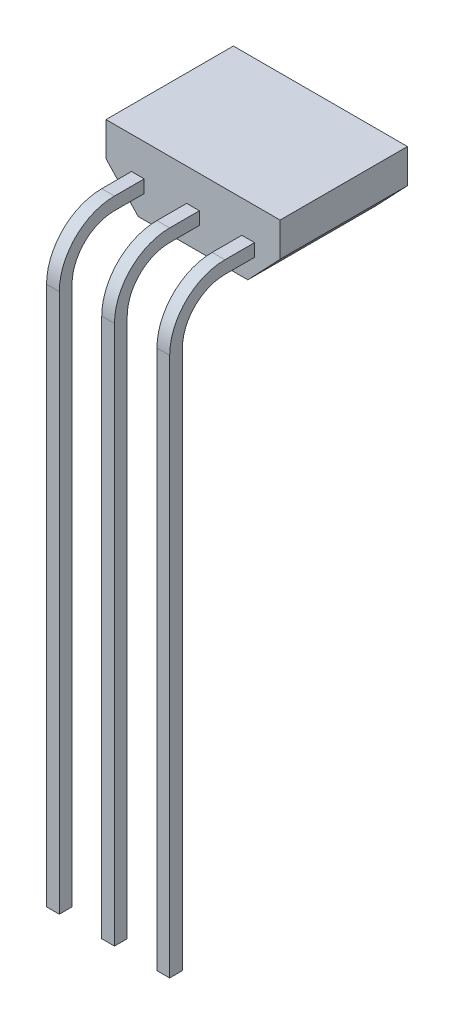
ISO-10303-21;
HEADER;
FILE_DESCRIPTION(('STEP AP214'),'2;1');
FILE_NAME('part.step','',(''),(''),'','','');
FILE_SCHEMA(('AUTOMOTIVE_DESIGN { 1 0 10303 214 1 1 1 1 }'));
ENDSEC;
DATA;
#1=APPLICATION_CONTEXT('core data for automotive mechanical design processes');
#2=APPLICATION_PROTOCOL_DEFINITION('international standard','automotive_design',2000,#1);
#3=PRODUCT_CONTEXT('',#1,'mechanical');
#4=PRODUCT('Part','Part','',(#3));
#5=PRODUCT_RELATED_PRODUCT_CATEGORY('part','',(#4));
#6=PRODUCT_DEFINITION_FORMATION('','',#4);
#7=PRODUCT_DEFINITION_CONTEXT('part definition',#1,'design');
#8=PRODUCT_DEFINITION('design','',#6,#7);
#9=PRODUCT_DEFINITION_SHAPE('','',#8);
#10=(LENGTH_UNIT() NAMED_UNIT(*) SI_UNIT(.MILLI.,.METRE.));
#11=(NAMED_UNIT(*) PLANE_ANGLE_UNIT() SI_UNIT($,.RADIAN.));
#12=(NAMED_UNIT(*) SI_UNIT($,.STERADIAN.) SOLID_ANGLE_UNIT());
#13=UNCERTAINTY_MEASURE_WITH_UNIT(LENGTH_MEASURE(1.E-05),#10,'distance_accuracy_value','');
#14=(GEOMETRIC_REPRESENTATION_CONTEXT(3) GLOBAL_UNCERTAINTY_ASSIGNED_CONTEXT((#13)) GLOBAL_UNIT_ASSIGNED_CONTEXT((#10,
#11,#12)) REPRESENTATION_CONTEXT('',''));
#15=CARTESIAN_POINT('',(0.,0.,0.));
#16=DIRECTION('',(0.,0.,1.));
#17=DIRECTION('',(1.,0.,0.));
#18=AXIS2_PLACEMENT_3D('',#15,#16,#17);
#19=CARTESIAN_POINT('',(2.05,1.6,1.5));
#20=DIRECTION('',(0.,0.,-1.));
#21=DIRECTION('',(-1.,0.,0.));
#22=AXIS2_PLACEMENT_3D('',#19,#20,#21);
#23=PLANE('',#22);
#24=DIRECTION('',(0.,1.,0.));
#25=VECTOR('',#24,1.);
#26=CARTESIAN_POINT('',(-1.15,0.839999999999998,1.5));
#27=LINE('',#26,#25);
#28=CARTESIAN_POINT('',(-1.15,0.539999999999998,1.5));
#29=VERTEX_POINT('',#28);
#30=CARTESIAN_POINT('',(-1.15,0.839999999999998,1.5));
#31=VERTEX_POINT('',#30);
#32=EDGE_CURVE('E266',#29,#31,#27,.T.);
#33=ORIENTED_EDGE('',*,*,#32,.F.);
#34=DIRECTION('',(-1.,0.,0.));
#35=VECTOR('',#34,1.);
#36=CARTESIAN_POINT('',(-1.15,0.539999999999998,1.5));
#37=LINE('',#36,#35);
#38=CARTESIAN_POINT('',(-1.45,0.539999999999998,1.5));
#39=VERTEX_POINT('',#38);
#40=EDGE_CURVE('E283',#29,#39,#37,.T.);
#41=ORIENTED_EDGE('',*,*,#40,.T.);
#42=DIRECTION('',(0.,1.,0.));
#43=VECTOR('',#42,1.);
#44=CARTESIAN_POINT('',(-1.45,0.839999999999998,1.5));
#45=LINE('',#44,#43);
#46=CARTESIAN_POINT('',(-1.45,0.839999999999998,1.5));
#47=VERTEX_POINT('',#46);
#48=EDGE_CURVE('E257',#39,#47,#45,.T.);
#49=ORIENTED_EDGE('',*,*,#48,.T.);
#50=DIRECTION('',(-1.,0.,0.));
#51=VECTOR('',#50,1.);
#52=CARTESIAN_POINT('',(-1.15,0.839999999999998,1.5));
#53=LINE('',#52,#51);
#54=EDGE_CURVE('E59',#31,#47,#53,.T.);
#55=ORIENTED_EDGE('',*,*,#54,.F.);
#56=EDGE_LOOP('',(#33,#41,#49,#55));
#57=FACE_BOUND('',#56,.T.);
#58=DIRECTION('',(0.,-1.,0.));
#59=VECTOR('',#58,1.);
#60=CARTESIAN_POINT('',(-2.05,1.6,1.5));
#61=LINE('',#60,#59);
#62=CARTESIAN_POINT('',(-2.05,1.6,1.5));
#63=VERTEX_POINT('',#62);
#64=CARTESIAN_POINT('',(-2.05,0.800000000000003,1.5));
#65=VERTEX_POINT('',#64);
#66=EDGE_CURVE('E399',#63,#65,#61,.T.);
#67=ORIENTED_EDGE('',*,*,#66,.T.);
#68=DIRECTION('',(-0.688749461914693,0.724999433594414,0.));
#69=VECTOR('',#68,1.);
#70=CARTESIAN_POINT('',(-2.05,0.800000000000003,1.5));
#71=LINE('',#70,#69);
#72=CARTESIAN_POINT('',(-1.29,0.,1.5));
#73=VERTEX_POINT('',#72);
#74=EDGE_CURVE('E407',#65,#73,#71,.F.);
#75=ORIENTED_EDGE('',*,*,#74,.T.);
#76=DIRECTION('',(1.,0.,0.));
#77=VECTOR('',#76,1.);
#78=CARTESIAN_POINT('',(2.05,0.,1.5));
#79=LINE('',#78,#77);
#80=CARTESIAN_POINT('',(1.29,0.,1.5));
#81=VERTEX_POINT('',#80);
#82=EDGE_CURVE('E375',#73,#81,#79,.T.);
#83=ORIENTED_EDGE('',*,*,#82,.T.);
#84=DIRECTION('',(-0.688749461914693,-0.724999433594414,0.));
#85=VECTOR('',#84,1.);
#86=CARTESIAN_POINT('',(2.05,0.800000000000003,1.5));
#87=LINE('',#86,#85);
#88=CARTESIAN_POINT('',(2.05,0.800000000000003,1.5));
#89=VERTEX_POINT('',#88);
#90=EDGE_CURVE('E405',#81,#89,#87,.F.);
#91=ORIENTED_EDGE('',*,*,#90,.T.);
#92=DIRECTION('',(0.,-1.,0.));
#93=VECTOR('',#92,1.);
#94=CARTESIAN_POINT('',(2.05,1.6,1.5));
#95=LINE('',#94,#93);
#96=CARTESIAN_POINT('',(2.05,1.6,1.5));
#97=VERTEX_POINT('',#96);
#98=EDGE_CURVE('E396',#97,#89,#95,.T.);
#99=ORIENTED_EDGE('',*,*,#98,.F.);
#100=DIRECTION('',(1.,0.,0.));
#101=VECTOR('',#100,1.);
#102=CARTESIAN_POINT('',(2.05,1.6,1.5));
#103=LINE('',#102,#101);
#104=EDGE_CURVE('E379',#63,#97,#103,.T.);
#105=ORIENTED_EDGE('',*,*,#104,.F.);
#106=EDGE_LOOP('',(#67,#75,#83,#91,#99,#105));
#107=FACE_BOUND('',#106,.T.);
#108=DIRECTION('',(0.,1.,0.));
#109=VECTOR('',#108,1.);
#110=CARTESIAN_POINT('',(0.15,0.839999999999998,1.5));
#111=LINE('',#110,#109);
#112=CARTESIAN_POINT('',(0.15,0.539999999999998,1.5));
#113=VERTEX_POINT('',#112);
#114=CARTESIAN_POINT('',(0.15,0.839999999999998,1.5));
#115=VERTEX_POINT('',#114);
#116=EDGE_CURVE('E319',#113,#115,#111,.T.);
#117=ORIENTED_EDGE('',*,*,#116,.F.);
#118=DIRECTION('',(-1.,0.,0.));
#119=VECTOR('',#118,1.);
#120=CARTESIAN_POINT('',(0.15,0.539999999999998,1.5));
#121=LINE('',#120,#119);
#122=CARTESIAN_POINT('',(-0.15,0.539999999999998,1.5));
#123=VERTEX_POINT('',#122);
#124=EDGE_CURVE('E337',#113,#123,#121,.T.);
#125=ORIENTED_EDGE('',*,*,#124,.T.);
#126=DIRECTION('',(0.,1.,0.));
#127=VECTOR('',#126,1.);
#128=CARTESIAN_POINT('',(-0.15,0.839999999999998,1.5));
#129=LINE('',#128,#127);
#130=CARTESIAN_POINT('',(-0.15,0.839999999999998,1.5));
#131=VERTEX_POINT('',#130);
#132=EDGE_CURVE('E318',#123,#131,#129,.T.);
#133=ORIENTED_EDGE('',*,*,#132,.T.);
#134=DIRECTION('',(-1.,0.,0.));
#135=VECTOR('',#134,1.);
#136=CARTESIAN_POINT('',(0.15,0.839999999999998,1.5));
#137=LINE('',#136,#135);
#138=EDGE_CURVE('E373',#115,#131,#137,.T.);
#139=ORIENTED_EDGE('',*,*,#138,.F.);
#140=EDGE_LOOP('',(#117,#125,#133,#139));
#141=FACE_BOUND('',#140,.T.);
#142=DIRECTION('',(0.,1.,0.));
#143=VECTOR('',#142,1.);
#144=CARTESIAN_POINT('',(1.15,0.839999999999998,1.5));
#145=LINE('',#144,#143);
#146=CARTESIAN_POINT('',(1.15,0.539999999999998,1.5));
#147=VERTEX_POINT('',#146);
#148=CARTESIAN_POINT('',(1.15,0.839999999999998,1.5));
#149=VERTEX_POINT('',#148);
#150=EDGE_CURVE('E235',#147,#149,#145,.T.);
#151=ORIENTED_EDGE('',*,*,#150,.T.);
#152=DIRECTION('',(1.,0.,0.));
#153=VECTOR('',#152,1.);
#154=CARTESIAN_POINT('',(1.15,0.839999999999998,1.5));
#155=LINE('',#154,#153);
#156=CARTESIAN_POINT('',(1.45,0.839999999999998,1.5));
#157=VERTEX_POINT('',#156);
#158=EDGE_CURVE('E779',#149,#157,#155,.T.);
#159=ORIENTED_EDGE('',*,*,#158,.T.);
#160=DIRECTION('',(0.,1.,0.));
#161=VECTOR('',#160,1.);
#162=CARTESIAN_POINT('',(1.45,0.839999999999998,1.5));
#163=LINE('',#162,#161);
#164=CARTESIAN_POINT('',(1.45,0.539999999999998,1.5));
#165=VERTEX_POINT('',#164);
#166=EDGE_CURVE('E256',#165,#157,#163,.T.);
#167=ORIENTED_EDGE('',*,*,#166,.F.);
#168=DIRECTION('',(1.,0.,0.));
#169=VECTOR('',#168,1.);
#170=CARTESIAN_POINT('',(1.15,0.539999999999998,1.5));
#171=LINE('',#170,#169);
#172=EDGE_CURVE('E251',#147,#165,#171,.T.);
#173=ORIENTED_EDGE('',*,*,#172,.F.);
#174=EDGE_LOOP('',(#151,#159,#167,#173));
#175=FACE_BOUND('',#174,.T.);
#176=ADVANCED_FACE('F35',(#57,#107,#141,#175),#23,.F.);
#177=CARTESIAN_POINT('',(-2.05,1.6,1.5));
#178=DIRECTION('',(1.,0.,0.));
#179=DIRECTION('',(0.,0.,-1.));
#180=AXIS2_PLACEMENT_3D('',#177,#178,#179);
#181=PLANE('',#180);
#182=DIRECTION('',(0.,-1.,0.));
#183=VECTOR('',#182,1.);
#184=CARTESIAN_POINT('',(-2.05,1.6,-1.5));
#185=LINE('',#184,#183);
#186=CARTESIAN_POINT('',(-2.05,1.6,-1.5));
#187=VERTEX_POINT('',#186);
#188=CARTESIAN_POINT('',(-2.05,0.800000000000003,-1.5));
#189=VERTEX_POINT('',#188);
#190=EDGE_CURVE('E386',#187,#189,#185,.T.);
#191=ORIENTED_EDGE('',*,*,#190,.T.);
#192=DIRECTION('',(0.,0.,1.));
#193=VECTOR('',#192,1.);
#194=CARTESIAN_POINT('',(-2.05,0.800000000000003,1.5));
#195=LINE('',#194,#193);
#196=EDGE_CURVE('E402',#189,#65,#195,.T.);
#197=ORIENTED_EDGE('',*,*,#196,.T.);
#198=ORIENTED_EDGE('',*,*,#66,.F.);
#199=DIRECTION('',(0.,0.,1.));
#200=VECTOR('',#199,1.);
#201=CARTESIAN_POINT('',(-2.05,1.6,1.5));
#202=LINE('',#201,#200);
#203=EDGE_CURVE('E376',#187,#63,#202,.T.);
#204=ORIENTED_EDGE('',*,*,#203,.F.);
#205=EDGE_LOOP('',(#191,#197,#198,#204));
#206=FACE_BOUND('',#205,.T.);
#207=ADVANCED_FACE('F425',(#206),#181,.F.);
#208=CARTESIAN_POINT('',(2.05,1.6,1.5));
#209=DIRECTION('',(-1.,0.,0.));
#210=DIRECTION('',(0.,0.,1.));
#211=AXIS2_PLACEMENT_3D('',#208,#209,#210);
#212=PLANE('',#211);
#213=ORIENTED_EDGE('',*,*,#98,.T.);
#214=DIRECTION('',(0.,0.,-1.));
#215=VECTOR('',#214,1.);
#216=CARTESIAN_POINT('',(2.05,0.800000000000003,1.5));
#217=LINE('',#216,#215);
#218=CARTESIAN_POINT('',(2.05,0.800000000000003,-1.5));
#219=VERTEX_POINT('',#218);
#220=EDGE_CURVE('E11',#89,#219,#217,.T.);
#221=ORIENTED_EDGE('',*,*,#220,.T.);
#222=DIRECTION('',(0.,-1.,0.));
#223=VECTOR('',#222,1.);
#224=CARTESIAN_POINT('',(2.05,1.6,-1.5));
#225=LINE('',#224,#223);
#226=CARTESIAN_POINT('',(2.05,1.6,-1.5));
#227=VERTEX_POINT('',#226);
#228=EDGE_CURVE('E393',#227,#219,#225,.T.);
#229=ORIENTED_EDGE('',*,*,#228,.F.);
#230=DIRECTION('',(0.,0.,-1.));
#231=VECTOR('',#230,1.);
#232=CARTESIAN_POINT('',(2.05,1.6,1.5));
#233=LINE('',#232,#231);
#234=EDGE_CURVE('E382',#97,#227,#233,.T.);
#235=ORIENTED_EDGE('',*,*,#234,.F.);
#236=EDGE_LOOP('',(#213,#221,#229,#235));
#237=FACE_BOUND('',#236,.T.);
#238=ADVANCED_FACE('F440',(#237),#212,.F.);
#239=CARTESIAN_POINT('',(2.05,1.6,-1.5));
#240=DIRECTION('',(0.,0.,1.));
#241=DIRECTION('',(1.,0.,0.));
#242=AXIS2_PLACEMENT_3D('',#239,#240,#241);
#243=PLANE('',#242);
#244=DIRECTION('',(-1.,0.,0.));
#245=VECTOR('',#244,1.);
#246=CARTESIAN_POINT('',(2.05,0.,-1.5));
#247=LINE('',#246,#245);
#248=CARTESIAN_POINT('',(1.29,0.,-1.5));
#249=VERTEX_POINT('',#248);
#250=CARTESIAN_POINT('',(-1.29,0.,-1.5));
#251=VERTEX_POINT('',#250);
#252=EDGE_CURVE('E380',#249,#251,#247,.T.);
#253=ORIENTED_EDGE('',*,*,#252,.T.);
#254=DIRECTION('',(0.688749461914693,-0.724999433594414,0.));
#255=VECTOR('',#254,1.);
#256=CARTESIAN_POINT('',(-2.05,0.800000000000003,-1.5));
#257=LINE('',#256,#255);
#258=EDGE_CURVE('E44',#251,#189,#257,.F.);
#259=ORIENTED_EDGE('',*,*,#258,.T.);
#260=ORIENTED_EDGE('',*,*,#190,.F.);
#261=DIRECTION('',(-1.,0.,0.));
#262=VECTOR('',#261,1.);
#263=CARTESIAN_POINT('',(2.05,1.6,-1.5));
#264=LINE('',#263,#262);
#265=EDGE_CURVE('E384',#227,#187,#264,.T.);
#266=ORIENTED_EDGE('',*,*,#265,.F.);
#267=ORIENTED_EDGE('',*,*,#228,.T.);
#268=DIRECTION('',(0.688749461914693,0.724999433594414,0.));
#269=VECTOR('',#268,1.);
#270=CARTESIAN_POINT('',(2.05,0.800000000000003,-1.5));
#271=LINE('',#270,#269);
#272=EDGE_CURVE('E413',#219,#249,#271,.F.);
#273=ORIENTED_EDGE('',*,*,#272,.T.);
#274=EDGE_LOOP('',(#253,#259,#260,#266,#267,#273));
#275=FACE_BOUND('',#274,.T.);
#276=ADVANCED_FACE('F417',(#275),#243,.F.);
#277=CARTESIAN_POINT('',(0.,1.6,0.));
#278=DIRECTION('',(0.,1.,0.));
#279=DIRECTION('',(0.,0.,1.));
#280=AXIS2_PLACEMENT_3D('',#277,#278,#279);
#281=PLANE('',#280);
#282=ORIENTED_EDGE('',*,*,#203,.T.);
#283=ORIENTED_EDGE('',*,*,#104,.T.);
#284=ORIENTED_EDGE('',*,*,#234,.T.);
#285=ORIENTED_EDGE('',*,*,#265,.T.);
#286=EDGE_LOOP('',(#282,#283,#284,#285));
#287=FACE_BOUND('',#286,.T.);
#288=ADVANCED_FACE('F443',(#287),#281,.T.);
#289=CARTESIAN_POINT('',(0.,0.,0.));
#290=DIRECTION('',(0.,1.,0.));
#291=DIRECTION('',(0.,0.,1.));
#292=AXIS2_PLACEMENT_3D('',#289,#290,#291);
#293=PLANE('',#292);
#294=ORIENTED_EDGE('',*,*,#82,.F.);
#295=DIRECTION('',(0.,0.,-1.));
#296=VECTOR('',#295,1.);
#297=CARTESIAN_POINT('',(-1.29,0.,0.));
#298=LINE('',#297,#296);
#299=EDGE_CURVE('E411',#73,#251,#298,.T.);
#300=ORIENTED_EDGE('',*,*,#299,.T.);
#301=ORIENTED_EDGE('',*,*,#252,.F.);
#302=DIRECTION('',(0.,0.,1.));
#303=VECTOR('',#302,1.);
#304=CARTESIAN_POINT('',(1.29,0.,0.));
#305=LINE('',#304,#303);
#306=EDGE_CURVE('E409',#249,#81,#305,.T.);
#307=ORIENTED_EDGE('',*,*,#306,.T.);
#308=EDGE_LOOP('',(#294,#300,#301,#307));
#309=FACE_BOUND('',#308,.T.);
#310=ADVANCED_FACE('F433',(#309),#293,.F.);
#311=CARTESIAN_POINT('',(-2.05,0.800000000000003,1.5));
#312=DIRECTION('',(0.724999433594414,0.688749461914693,0.));
#313=DIRECTION('',(0.,0.,1.));
#314=AXIS2_PLACEMENT_3D('',#311,#312,#313);
#315=PLANE('',#314);
#316=ORIENTED_EDGE('',*,*,#258,.F.);
#317=ORIENTED_EDGE('',*,*,#299,.F.);
#318=ORIENTED_EDGE('',*,*,#74,.F.);
#319=ORIENTED_EDGE('',*,*,#196,.F.);
#320=EDGE_LOOP('',(#316,#317,#318,#319));
#321=FACE_BOUND('',#320,.T.);
#322=ADVANCED_FACE('F427',(#321),#315,.F.);
#323=CARTESIAN_POINT('',(2.05,0.800000000000003,1.5));
#324=DIRECTION('',(-0.724999433594414,0.688749461914693,0.));
#325=DIRECTION('',(0.,0.,-1.));
#326=AXIS2_PLACEMENT_3D('',#323,#324,#325);
#327=PLANE('',#326);
#328=ORIENTED_EDGE('',*,*,#90,.F.);
#329=ORIENTED_EDGE('',*,*,#306,.F.);
#330=ORIENTED_EDGE('',*,*,#272,.F.);
#331=ORIENTED_EDGE('',*,*,#220,.F.);
#332=EDGE_LOOP('',(#328,#329,#330,#331));
#333=FACE_BOUND('',#332,.T.);
#334=ADVANCED_FACE('F38',(#333),#327,.F.);
#335=CARTESIAN_POINT('',(0.15,0.839999999999998,2.2));
#336=DIRECTION('',(0.,-1.,0.));
#337=DIRECTION('',(0.,0.,-1.));
#338=AXIS2_PLACEMENT_3D('',#335,#336,#337);
#339=PLANE('',#338);
#340=DIRECTION('',(0.,0.,1.));
#341=VECTOR('',#340,1.);
#342=CARTESIAN_POINT('',(-0.15,0.839999999999998,2.2));
#343=LINE('',#342,#341);
#344=CARTESIAN_POINT('',(-0.15,0.839999999999998,2.2));
#345=VERTEX_POINT('',#344);
#346=EDGE_CURVE('E340',#131,#345,#343,.T.);
#347=ORIENTED_EDGE('',*,*,#346,.T.);
#348=DIRECTION('',(-1.,0.,0.));
#349=VECTOR('',#348,1.);
#350=CARTESIAN_POINT('',(0.15,0.839999999999998,2.2));
#351=LINE('',#350,#349);
#352=CARTESIAN_POINT('',(0.15,0.839999999999998,2.2));
#353=VERTEX_POINT('',#352);
#354=EDGE_CURVE('E370',#353,#345,#351,.T.);
#355=ORIENTED_EDGE('',*,*,#354,.F.);
#356=DIRECTION('',(0.,0.,1.));
#357=VECTOR('',#356,1.);
#358=CARTESIAN_POINT('',(0.15,0.839999999999998,2.2));
#359=LINE('',#358,#357);
#360=EDGE_CURVE('E322',#115,#353,#359,.T.);
#361=ORIENTED_EDGE('',*,*,#360,.F.);
#362=ORIENTED_EDGE('',*,*,#138,.T.);
#363=EDGE_LOOP('',(#347,#355,#361,#362));
#364=FACE_BOUND('',#363,.T.);
#365=ADVANCED_FACE('F469',(#364),#339,.F.);
#366=CARTESIAN_POINT('',(0.15,-0.460000000000002,2.2));
#367=DIRECTION('',(-1.,0.,0.));
#368=DIRECTION('',(0.,0.,1.));
#369=AXIS2_PLACEMENT_3D('',#366,#367,#368);
#370=CYLINDRICAL_SURFACE('',#369,1.3);
#371=CARTESIAN_POINT('',(-0.15,-0.460000000000002,2.2));
#372=DIRECTION('',(1.,0.,0.));
#373=DIRECTION('',(0.,0.,-1.));
#374=AXIS2_PLACEMENT_3D('',#371,#372,#373);
#375=CIRCLE('',#374,1.3);
#376=CARTESIAN_POINT('',(-0.15,-0.460000000000002,3.5));
#377=VERTEX_POINT('',#376);
#378=EDGE_CURVE('E342',#345,#377,#375,.T.);
#379=ORIENTED_EDGE('',*,*,#378,.T.);
#380=DIRECTION('',(-1.,0.,0.));
#381=VECTOR('',#380,1.);
#382=CARTESIAN_POINT('',(0.15,-0.460000000000002,3.5));
#383=LINE('',#382,#381);
#384=CARTESIAN_POINT('',(0.15,-0.460000000000002,3.5));
#385=VERTEX_POINT('',#384);
#386=EDGE_CURVE('E367',#385,#377,#383,.T.);
#387=ORIENTED_EDGE('',*,*,#386,.F.);
#388=CARTESIAN_POINT('',(0.15,-0.460000000000002,2.2));
#389=DIRECTION('',(1.,0.,0.));
#390=DIRECTION('',(0.,0.,-1.));
#391=AXIS2_PLACEMENT_3D('',#388,#389,#390);
#392=CIRCLE('',#391,1.3);
#393=EDGE_CURVE('E325',#353,#385,#392,.T.);
#394=ORIENTED_EDGE('',*,*,#393,.F.);
#395=ORIENTED_EDGE('',*,*,#354,.T.);
#396=EDGE_LOOP('',(#379,#387,#394,#395));
#397=FACE_BOUND('',#396,.T.);
#398=ADVANCED_FACE('F473',(#397),#370,.T.);
#399=CARTESIAN_POINT('',(0.15,-0.460000000000002,3.5));
#400=DIRECTION('',(0.,0.,-1.));
#401=DIRECTION('',(0.,1.,0.));
#402=AXIS2_PLACEMENT_3D('',#399,#400,#401);
#403=PLANE('',#402);
#404=DIRECTION('',(0.,-1.,0.));
#405=VECTOR('',#404,1.);
#406=CARTESIAN_POINT('',(-0.15,-0.460000000000002,3.5));
#407=LINE('',#406,#405);
#408=CARTESIAN_POINT('',(-0.15,-13.16,3.5));
#409=VERTEX_POINT('',#408);
#410=EDGE_CURVE('E344',#377,#409,#407,.T.);
#411=ORIENTED_EDGE('',*,*,#410,.T.);
#412=DIRECTION('',(-1.,0.,0.));
#413=VECTOR('',#412,1.);
#414=CARTESIAN_POINT('',(0.15,-13.16,3.5));
#415=LINE('',#414,#413);
#416=CARTESIAN_POINT('',(0.15,-13.16,3.5));
#417=VERTEX_POINT('',#416);
#418=EDGE_CURVE('E364',#417,#409,#415,.T.);
#419=ORIENTED_EDGE('',*,*,#418,.F.);
#420=DIRECTION('',(0.,-1.,0.));
#421=VECTOR('',#420,1.);
#422=CARTESIAN_POINT('',(0.15,-0.460000000000002,3.5));
#423=LINE('',#422,#421);
#424=EDGE_CURVE('E327',#385,#417,#423,.T.);
#425=ORIENTED_EDGE('',*,*,#424,.F.);
#426=ORIENTED_EDGE('',*,*,#386,.T.);
#427=EDGE_LOOP('',(#411,#419,#425,#426));
#428=FACE_BOUND('',#427,.T.);
#429=ADVANCED_FACE('F478',(#428),#403,.F.);
#430=CARTESIAN_POINT('',(0.15,-13.16,3.5));
#431=DIRECTION('',(0.,1.,0.));
#432=DIRECTION('',(0.,0.,1.));
#433=AXIS2_PLACEMENT_3D('',#430,#431,#432);
#434=PLANE('',#433);
#435=DIRECTION('',(0.,0.,-1.));
#436=VECTOR('',#435,1.);
#437=CARTESIAN_POINT('',(-0.15,-13.16,3.5));
#438=LINE('',#437,#436);
#439=CARTESIAN_POINT('',(-0.15,-13.16,3.2));
#440=VERTEX_POINT('',#439);
#441=EDGE_CURVE('E346',#409,#440,#438,.T.);
#442=ORIENTED_EDGE('',*,*,#441,.T.);
#443=DIRECTION('',(-1.,0.,0.));
#444=VECTOR('',#443,1.);
#445=CARTESIAN_POINT('',(0.15,-13.16,3.2));
#446=LINE('',#445,#444);
#447=CARTESIAN_POINT('',(0.15,-13.16,3.2));
#448=VERTEX_POINT('',#447);
#449=EDGE_CURVE('E361',#448,#440,#446,.T.);
#450=ORIENTED_EDGE('',*,*,#449,.F.);
#451=DIRECTION('',(0.,0.,-1.));
#452=VECTOR('',#451,1.);
#453=CARTESIAN_POINT('',(0.15,-13.16,3.5));
#454=LINE('',#453,#452);
#455=EDGE_CURVE('E329',#417,#448,#454,.T.);
#456=ORIENTED_EDGE('',*,*,#455,.F.);
#457=ORIENTED_EDGE('',*,*,#418,.T.);
#458=EDGE_LOOP('',(#442,#450,#456,#457));
#459=FACE_BOUND('',#458,.T.);
#460=ADVANCED_FACE('F484',(#459),#434,.F.);
#461=CARTESIAN_POINT('',(0.15,-0.460000000000003,3.2));
#462=DIRECTION('',(0.,0.,1.));
#463=DIRECTION('',(0.,-1.,0.));
#464=AXIS2_PLACEMENT_3D('',#461,#462,#463);
#465=PLANE('',#464);
#466=DIRECTION('',(0.,1.,0.));
#467=VECTOR('',#466,1.);
#468=CARTESIAN_POINT('',(-0.15,-0.460000000000003,3.2));
#469=LINE('',#468,#467);
#470=CARTESIAN_POINT('',(-0.15,-0.460000000000003,3.2));
#471=VERTEX_POINT('',#470);
#472=EDGE_CURVE('E348',#440,#471,#469,.T.);
#473=ORIENTED_EDGE('',*,*,#472,.T.);
#474=DIRECTION('',(-1.,0.,0.));
#475=VECTOR('',#474,1.);
#476=CARTESIAN_POINT('',(0.15,-0.460000000000003,3.2));
#477=LINE('',#476,#475);
#478=CARTESIAN_POINT('',(0.15,-0.460000000000003,3.2));
#479=VERTEX_POINT('',#478);
#480=EDGE_CURVE('E358',#479,#471,#477,.T.);
#481=ORIENTED_EDGE('',*,*,#480,.F.);
#482=DIRECTION('',(0.,1.,0.));
#483=VECTOR('',#482,1.);
#484=CARTESIAN_POINT('',(0.15,-0.460000000000003,3.2));
#485=LINE('',#484,#483);
#486=EDGE_CURVE('E331',#448,#479,#485,.T.);
#487=ORIENTED_EDGE('',*,*,#486,.F.);
#488=ORIENTED_EDGE('',*,*,#449,.T.);
#489=EDGE_LOOP('',(#473,#481,#487,#488));
#490=FACE_BOUND('',#489,.T.);
#491=ADVANCED_FACE('F488',(#490),#465,.F.);
#492=CARTESIAN_POINT('',(0.15,-0.460000000000002,2.2));
#493=DIRECTION('',(-1.,0.,0.));
#494=DIRECTION('',(0.,0.,1.));
#495=AXIS2_PLACEMENT_3D('',#492,#493,#494);
#496=CYLINDRICAL_SURFACE('',#495,1.);
#497=CARTESIAN_POINT('',(-0.15,-0.460000000000002,2.2));
#498=DIRECTION('',(-1.,0.,0.));
#499=DIRECTION('',(0.,0.,1.));
#500=AXIS2_PLACEMENT_3D('',#497,#498,#499);
#501=CIRCLE('',#500,1.);
#502=CARTESIAN_POINT('',(-0.15,0.539999999999997,2.19999999999999));
#503=VERTEX_POINT('',#502);
#504=EDGE_CURVE('E350',#471,#503,#501,.T.);
#505=ORIENTED_EDGE('',*,*,#504,.T.);
#506=DIRECTION('',(-1.,0.,0.));
#507=VECTOR('',#506,1.);
#508=CARTESIAN_POINT('',(0.15,0.539999999999997,2.19999999999999));
#509=LINE('',#508,#507);
#510=CARTESIAN_POINT('',(0.15,0.539999999999997,2.19999999999999));
#511=VERTEX_POINT('',#510);
#512=EDGE_CURVE('E355',#511,#503,#509,.T.);
#513=ORIENTED_EDGE('',*,*,#512,.F.);
#514=CARTESIAN_POINT('',(0.15,-0.460000000000002,2.2));
#515=DIRECTION('',(-1.,0.,0.));
#516=DIRECTION('',(0.,0.,1.));
#517=AXIS2_PLACEMENT_3D('',#514,#515,#516);
#518=CIRCLE('',#517,1.);
#519=EDGE_CURVE('E333',#479,#511,#518,.T.);
#520=ORIENTED_EDGE('',*,*,#519,.F.);
#521=ORIENTED_EDGE('',*,*,#480,.T.);
#522=EDGE_LOOP('',(#505,#513,#520,#521));
#523=FACE_BOUND('',#522,.T.);
#524=ADVANCED_FACE('F492',(#523),#496,.F.);
#525=CARTESIAN_POINT('',(0.15,0.539999999999998,1.5));
#526=DIRECTION('',(0.,1.,0.));
#527=DIRECTION('',(0.,0.,1.));
#528=AXIS2_PLACEMENT_3D('',#525,#526,#527);
#529=PLANE('',#528);
#530=DIRECTION('',(0.,0.,-1.));
#531=VECTOR('',#530,1.);
#532=CARTESIAN_POINT('',(-0.15,0.539999999999998,1.5));
#533=LINE('',#532,#531);
#534=EDGE_CURVE('E323',#503,#123,#533,.T.);
#535=ORIENTED_EDGE('',*,*,#534,.T.);
#536=ORIENTED_EDGE('',*,*,#124,.F.);
#537=DIRECTION('',(0.,0.,-1.));
#538=VECTOR('',#537,1.);
#539=CARTESIAN_POINT('',(0.15,0.539999999999998,1.5));
#540=LINE('',#539,#538);
#541=EDGE_CURVE('E335',#511,#113,#540,.T.);
#542=ORIENTED_EDGE('',*,*,#541,.F.);
#543=ORIENTED_EDGE('',*,*,#512,.T.);
#544=EDGE_LOOP('',(#535,#536,#542,#543));
#545=FACE_BOUND('',#544,.T.);
#546=ADVANCED_FACE('F496',(#545),#529,.F.);
#547=CARTESIAN_POINT('',(0.15,-0.460000000000002,2.2));
#548=DIRECTION('',(-1.,0.,0.));
#549=DIRECTION('',(0.,0.,1.));
#550=AXIS2_PLACEMENT_3D('',#547,#548,#549);
#551=PLANE('',#550);
#552=ORIENTED_EDGE('',*,*,#116,.T.);
#553=ORIENTED_EDGE('',*,*,#360,.T.);
#554=ORIENTED_EDGE('',*,*,#393,.T.);
#555=ORIENTED_EDGE('',*,*,#424,.T.);
#556=ORIENTED_EDGE('',*,*,#455,.T.);
#557=ORIENTED_EDGE('',*,*,#486,.T.);
#558=ORIENTED_EDGE('',*,*,#519,.T.);
#559=ORIENTED_EDGE('',*,*,#541,.T.);
#560=EDGE_LOOP('',(#552,#553,#554,#555,#556,#557,#558,#559));
#561=FACE_BOUND('',#560,.T.);
#562=ADVANCED_FACE('F500',(#561),#551,.F.);
#563=CARTESIAN_POINT('',(-0.15,-0.460000000000002,2.2));
#564=DIRECTION('',(-1.,0.,0.));
#565=DIRECTION('',(0.,0.,1.));
#566=AXIS2_PLACEMENT_3D('',#563,#564,#565);
#567=PLANE('',#566);
#568=ORIENTED_EDGE('',*,*,#132,.F.);
#569=ORIENTED_EDGE('',*,*,#534,.F.);
#570=ORIENTED_EDGE('',*,*,#504,.F.);
#571=ORIENTED_EDGE('',*,*,#472,.F.);
#572=ORIENTED_EDGE('',*,*,#441,.F.);
#573=ORIENTED_EDGE('',*,*,#410,.F.);
#574=ORIENTED_EDGE('',*,*,#378,.F.);
#575=ORIENTED_EDGE('',*,*,#346,.F.);
#576=EDGE_LOOP('',(#568,#569,#570,#571,#572,#573,#574,#575));
#577=FACE_BOUND('',#576,.T.);
#578=ADVANCED_FACE('F502',(#577),#567,.T.);
#579=CARTESIAN_POINT('',(-1.15,0.839999999999998,2.2));
#580=DIRECTION('',(0.,-1.,0.));
#581=DIRECTION('',(0.,0.,-1.));
#582=AXIS2_PLACEMENT_3D('',#579,#580,#581);
#583=PLANE('',#582);
#584=DIRECTION('',(0.,0.,1.));
#585=VECTOR('',#584,1.);
#586=CARTESIAN_POINT('',(-1.45,0.839999999999998,2.2));
#587=LINE('',#586,#585);
#588=CARTESIAN_POINT('',(-1.45,0.839999999999998,2.2));
#589=VERTEX_POINT('',#588);
#590=EDGE_CURVE('E260',#47,#589,#587,.T.);
#591=ORIENTED_EDGE('',*,*,#590,.T.);
#592=DIRECTION('',(-1.,0.,0.));
#593=VECTOR('',#592,1.);
#594=CARTESIAN_POINT('',(-1.15,0.839999999999998,2.2));
#595=LINE('',#594,#593);
#596=CARTESIAN_POINT('',(-1.15,0.839999999999998,2.2));
#597=VERTEX_POINT('',#596);
#598=EDGE_CURVE('E314',#597,#589,#595,.T.);
#599=ORIENTED_EDGE('',*,*,#598,.F.);
#600=DIRECTION('',(0.,0.,1.));
#601=VECTOR('',#600,1.);
#602=CARTESIAN_POINT('',(-1.15,0.839999999999998,2.2));
#603=LINE('',#602,#601);
#604=EDGE_CURVE('E269',#31,#597,#603,.T.);
#605=ORIENTED_EDGE('',*,*,#604,.F.);
#606=ORIENTED_EDGE('',*,*,#54,.T.);
#607=EDGE_LOOP('',(#591,#599,#605,#606));
#608=FACE_BOUND('',#607,.T.);
#609=ADVANCED_FACE('F505',(#608),#583,.F.);
#610=CARTESIAN_POINT('',(-1.15,-0.460000000000002,2.2));
#611=DIRECTION('',(-1.,0.,0.));
#612=DIRECTION('',(0.,0.,1.));
#613=AXIS2_PLACEMENT_3D('',#610,#611,#612);
#614=CYLINDRICAL_SURFACE('',#613,1.3);
#615=CARTESIAN_POINT('',(-1.45,-0.460000000000002,2.2));
#616=DIRECTION('',(1.,0.,0.));
#617=DIRECTION('',(0.,0.,-1.));
#618=AXIS2_PLACEMENT_3D('',#615,#616,#617);
#619=CIRCLE('',#618,1.3);
#620=CARTESIAN_POINT('',(-1.45,-0.460000000000002,3.5));
#621=VERTEX_POINT('',#620);
#622=EDGE_CURVE('E286',#589,#621,#619,.T.);
#623=ORIENTED_EDGE('',*,*,#622,.T.);
#624=DIRECTION('',(-1.,0.,0.));
#625=VECTOR('',#624,1.);
#626=CARTESIAN_POINT('',(-1.15,-0.460000000000002,3.5));
#627=LINE('',#626,#625);
#628=CARTESIAN_POINT('',(-1.15,-0.460000000000002,3.5));
#629=VERTEX_POINT('',#628);
#630=EDGE_CURVE('E311',#629,#621,#627,.T.);
#631=ORIENTED_EDGE('',*,*,#630,.F.);
#632=CARTESIAN_POINT('',(-1.15,-0.460000000000002,2.2));
#633=DIRECTION('',(1.,0.,0.));
#634=DIRECTION('',(0.,0.,-1.));
#635=AXIS2_PLACEMENT_3D('',#632,#633,#634);
#636=CIRCLE('',#635,1.3);
#637=EDGE_CURVE('E272',#597,#629,#636,.T.);
#638=ORIENTED_EDGE('',*,*,#637,.F.);
#639=ORIENTED_EDGE('',*,*,#598,.T.);
#640=EDGE_LOOP('',(#623,#631,#638,#639));
#641=FACE_BOUND('',#640,.T.);
#642=ADVANCED_FACE('F512',(#641),#614,.T.);
#643=CARTESIAN_POINT('',(-1.15,-0.460000000000002,3.5));
#644=DIRECTION('',(0.,0.,-1.));
#645=DIRECTION('',(0.,1.,0.));
#646=AXIS2_PLACEMENT_3D('',#643,#644,#645);
#647=PLANE('',#646);
#648=DIRECTION('',(0.,-1.,0.));
#649=VECTOR('',#648,1.);
#650=CARTESIAN_POINT('',(-1.45,-0.460000000000002,3.5));
#651=LINE('',#650,#649);
#652=CARTESIAN_POINT('',(-1.45,-13.16,3.5));
#653=VERTEX_POINT('',#652);
#654=EDGE_CURVE('E288',#621,#653,#651,.T.);
#655=ORIENTED_EDGE('',*,*,#654,.T.);
#656=DIRECTION('',(-1.,0.,0.));
#657=VECTOR('',#656,1.);
#658=CARTESIAN_POINT('',(-1.15,-13.16,3.5));
#659=LINE('',#658,#657);
#660=CARTESIAN_POINT('',(-1.15,-13.16,3.5));
#661=VERTEX_POINT('',#660);
#662=EDGE_CURVE('E308',#661,#653,#659,.T.);
#663=ORIENTED_EDGE('',*,*,#662,.F.);
#664=DIRECTION('',(0.,-1.,0.));
#665=VECTOR('',#664,1.);
#666=CARTESIAN_POINT('',(-1.15,-0.460000000000002,3.5));
#667=LINE('',#666,#665);
#668=EDGE_CURVE('E274',#629,#661,#667,.T.);
#669=ORIENTED_EDGE('',*,*,#668,.F.);
#670=ORIENTED_EDGE('',*,*,#630,.T.);
#671=EDGE_LOOP('',(#655,#663,#669,#670));
#672=FACE_BOUND('',#671,.T.);
#673=ADVANCED_FACE('F515',(#672),#647,.F.);
#674=CARTESIAN_POINT('',(-1.15,-13.16,3.5));
#675=DIRECTION('',(0.,1.,0.));
#676=DIRECTION('',(0.,0.,1.));
#677=AXIS2_PLACEMENT_3D('',#674,#675,#676);
#678=PLANE('',#677);
#679=DIRECTION('',(0.,0.,-1.));
#680=VECTOR('',#679,1.);
#681=CARTESIAN_POINT('',(-1.45,-13.16,3.5));
#682=LINE('',#681,#680);
#683=CARTESIAN_POINT('',(-1.45,-13.16,3.2));
#684=VERTEX_POINT('',#683);
#685=EDGE_CURVE('E290',#653,#684,#682,.T.);
#686=ORIENTED_EDGE('',*,*,#685,.T.);
#687=DIRECTION('',(-1.,0.,0.));
#688=VECTOR('',#687,1.);
#689=CARTESIAN_POINT('',(-1.15,-13.16,3.2));
#690=LINE('',#689,#688);
#691=CARTESIAN_POINT('',(-1.15,-13.16,3.2));
#692=VERTEX_POINT('',#691);
#693=EDGE_CURVE('E305',#692,#684,#690,.T.);
#694=ORIENTED_EDGE('',*,*,#693,.F.);
#695=DIRECTION('',(0.,0.,-1.));
#696=VECTOR('',#695,1.);
#697=CARTESIAN_POINT('',(-1.15,-13.16,3.5));
#698=LINE('',#697,#696);
#699=EDGE_CURVE('E276',#661,#692,#698,.T.);
#700=ORIENTED_EDGE('',*,*,#699,.F.);
#701=ORIENTED_EDGE('',*,*,#662,.T.);
#702=EDGE_LOOP('',(#686,#694,#700,#701));
#703=FACE_BOUND('',#702,.T.);
#704=ADVANCED_FACE('F519',(#703),#678,.F.);
#705=CARTESIAN_POINT('',(-1.15,-0.460000000000003,3.2));
#706=DIRECTION('',(0.,0.,1.));
#707=DIRECTION('',(0.,-1.,0.));
#708=AXIS2_PLACEMENT_3D('',#705,#706,#707);
#709=PLANE('',#708);
#710=DIRECTION('',(0.,1.,0.));
#711=VECTOR('',#710,1.);
#712=CARTESIAN_POINT('',(-1.45,-0.460000000000003,3.2));
#713=LINE('',#712,#711);
#714=CARTESIAN_POINT('',(-1.45,-0.460000000000003,3.2));
#715=VERTEX_POINT('',#714);
#716=EDGE_CURVE('E292',#684,#715,#713,.T.);
#717=ORIENTED_EDGE('',*,*,#716,.T.);
#718=DIRECTION('',(-1.,0.,0.));
#719=VECTOR('',#718,1.);
#720=CARTESIAN_POINT('',(-1.15,-0.460000000000003,3.2));
#721=LINE('',#720,#719);
#722=CARTESIAN_POINT('',(-1.15,-0.460000000000003,3.2));
#723=VERTEX_POINT('',#722);
#724=EDGE_CURVE('E302',#723,#715,#721,.T.);
#725=ORIENTED_EDGE('',*,*,#724,.F.);
#726=DIRECTION('',(0.,1.,0.));
#727=VECTOR('',#726,1.);
#728=CARTESIAN_POINT('',(-1.15,-0.460000000000003,3.2));
#729=LINE('',#728,#727);
#730=EDGE_CURVE('E278',#692,#723,#729,.T.);
#731=ORIENTED_EDGE('',*,*,#730,.F.);
#732=ORIENTED_EDGE('',*,*,#693,.T.);
#733=EDGE_LOOP('',(#717,#725,#731,#732));
#734=FACE_BOUND('',#733,.T.);
#735=ADVANCED_FACE('F523',(#734),#709,.F.);
#736=CARTESIAN_POINT('',(-1.15,-0.460000000000002,2.2));
#737=DIRECTION('',(-1.,0.,0.));
#738=DIRECTION('',(0.,0.,1.));
#739=AXIS2_PLACEMENT_3D('',#736,#737,#738);
#740=CYLINDRICAL_SURFACE('',#739,1.);
#741=CARTESIAN_POINT('',(-1.45,-0.460000000000002,2.2));
#742=DIRECTION('',(-1.,0.,0.));
#743=DIRECTION('',(0.,0.,1.));
#744=AXIS2_PLACEMENT_3D('',#741,#742,#743);
#745=CIRCLE('',#744,1.);
#746=CARTESIAN_POINT('',(-1.45,0.539999999999997,2.19999999999999));
#747=VERTEX_POINT('',#746);
#748=EDGE_CURVE('E294',#715,#747,#745,.T.);
#749=ORIENTED_EDGE('',*,*,#748,.T.);
#750=DIRECTION('',(-1.,0.,0.));
#751=VECTOR('',#750,1.);
#752=CARTESIAN_POINT('',(-1.15,0.539999999999997,2.19999999999999));
#753=LINE('',#752,#751);
#754=CARTESIAN_POINT('',(-1.15,0.539999999999997,2.19999999999999));
#755=VERTEX_POINT('',#754);
#756=EDGE_CURVE('E299',#755,#747,#753,.T.);
#757=ORIENTED_EDGE('',*,*,#756,.F.);
#758=CARTESIAN_POINT('',(-1.15,-0.460000000000002,2.2));
#759=DIRECTION('',(-1.,0.,0.));
#760=DIRECTION('',(0.,0.,1.));
#761=AXIS2_PLACEMENT_3D('',#758,#759,#760);
#762=CIRCLE('',#761,1.);
#763=EDGE_CURVE('E280',#723,#755,#762,.T.);
#764=ORIENTED_EDGE('',*,*,#763,.F.);
#765=ORIENTED_EDGE('',*,*,#724,.T.);
#766=EDGE_LOOP('',(#749,#757,#764,#765));
#767=FACE_BOUND('',#766,.T.);
#768=ADVANCED_FACE('F527',(#767),#740,.F.);
#769=CARTESIAN_POINT('',(-1.15,0.539999999999998,1.5));
#770=DIRECTION('',(0.,1.,0.));
#771=DIRECTION('',(0.,0.,1.));
#772=AXIS2_PLACEMENT_3D('',#769,#770,#771);
#773=PLANE('',#772);
#774=DIRECTION('',(0.,0.,-1.));
#775=VECTOR('',#774,1.);
#776=CARTESIAN_POINT('',(-1.45,0.539999999999998,1.5));
#777=LINE('',#776,#775);
#778=EDGE_CURVE('E270',#747,#39,#777,.T.);
#779=ORIENTED_EDGE('',*,*,#778,.T.);
#780=ORIENTED_EDGE('',*,*,#40,.F.);
#781=DIRECTION('',(0.,0.,-1.));
#782=VECTOR('',#781,1.);
#783=CARTESIAN_POINT('',(-1.15,0.539999999999998,1.5));
#784=LINE('',#783,#782);
#785=EDGE_CURVE('E282',#755,#29,#784,.T.);
#786=ORIENTED_EDGE('',*,*,#785,.F.);
#787=ORIENTED_EDGE('',*,*,#756,.T.);
#788=EDGE_LOOP('',(#779,#780,#786,#787));
#789=FACE_BOUND('',#788,.T.);
#790=ADVANCED_FACE('F531',(#789),#773,.F.);
#791=CARTESIAN_POINT('',(-1.15,-0.460000000000002,2.2));
#792=DIRECTION('',(-1.,0.,0.));
#793=DIRECTION('',(0.,0.,1.));
#794=AXIS2_PLACEMENT_3D('',#791,#792,#793);
#795=PLANE('',#794);
#796=ORIENTED_EDGE('',*,*,#32,.T.);
#797=ORIENTED_EDGE('',*,*,#604,.T.);
#798=ORIENTED_EDGE('',*,*,#637,.T.);
#799=ORIENTED_EDGE('',*,*,#668,.T.);
#800=ORIENTED_EDGE('',*,*,#699,.T.);
#801=ORIENTED_EDGE('',*,*,#730,.T.);
#802=ORIENTED_EDGE('',*,*,#763,.T.);
#803=ORIENTED_EDGE('',*,*,#785,.T.);
#804=EDGE_LOOP('',(#796,#797,#798,#799,#800,#801,#802,#803));
#805=FACE_BOUND('',#804,.T.);
#806=ADVANCED_FACE('F535',(#805),#795,.F.);
#807=CARTESIAN_POINT('',(-1.45,-0.460000000000002,2.2));
#808=DIRECTION('',(-1.,0.,0.));
#809=DIRECTION('',(0.,0.,1.));
#810=AXIS2_PLACEMENT_3D('',#807,#808,#809);
#811=PLANE('',#810);
#812=ORIENTED_EDGE('',*,*,#48,.F.);
#813=ORIENTED_EDGE('',*,*,#778,.F.);
#814=ORIENTED_EDGE('',*,*,#748,.F.);
#815=ORIENTED_EDGE('',*,*,#716,.F.);
#816=ORIENTED_EDGE('',*,*,#685,.F.);
#817=ORIENTED_EDGE('',*,*,#654,.F.);
#818=ORIENTED_EDGE('',*,*,#622,.F.);
#819=ORIENTED_EDGE('',*,*,#590,.F.);
#820=EDGE_LOOP('',(#812,#813,#814,#815,#816,#817,#818,#819));
#821=FACE_BOUND('',#820,.T.);
#822=ADVANCED_FACE('F537',(#821),#811,.T.);
#823=CARTESIAN_POINT('',(1.15,0.539999999999998,1.5));
#824=DIRECTION('',(0.,-1.,0.));
#825=DIRECTION('',(0.,0.,-1.));
#826=AXIS2_PLACEMENT_3D('',#823,#824,#825);
#827=PLANE('',#826);
#828=DIRECTION('',(0.,0.,-1.));
#829=VECTOR('',#828,1.);
#830=CARTESIAN_POINT('',(1.45,0.539999999999998,1.5));
#831=LINE('',#830,#829);
#832=CARTESIAN_POINT('',(1.45,0.539999999999997,2.19999999999999));
#833=VERTEX_POINT('',#832);
#834=EDGE_CURVE('E51',#833,#165,#831,.T.);
#835=ORIENTED_EDGE('',*,*,#834,.F.);
#836=DIRECTION('',(1.,0.,0.));
#837=VECTOR('',#836,1.);
#838=CARTESIAN_POINT('',(1.15,0.539999999999997,2.19999999999999));
#839=LINE('',#838,#837);
#840=CARTESIAN_POINT('',(1.15,0.539999999999997,2.19999999999999));
#841=VERTEX_POINT('',#840);
#842=EDGE_CURVE('E253',#841,#833,#839,.T.);
#843=ORIENTED_EDGE('',*,*,#842,.F.);
#844=DIRECTION('',(0.,0.,-1.));
#845=VECTOR('',#844,1.);
#846=CARTESIAN_POINT('',(1.15,0.539999999999998,1.5));
#847=LINE('',#846,#845);
#848=EDGE_CURVE('E239',#841,#147,#847,.T.);
#849=ORIENTED_EDGE('',*,*,#848,.T.);
#850=ORIENTED_EDGE('',*,*,#172,.T.);
#851=EDGE_LOOP('',(#835,#843,#849,#850));
#852=FACE_BOUND('',#851,.T.);
#853=ADVANCED_FACE('F250',(#852),#827,.T.);
#854=CARTESIAN_POINT('',(1.15,-0.460000000000002,2.2));
#855=DIRECTION('',(1.,0.,0.));
#856=DIRECTION('',(0.,0.,-1.));
#857=AXIS2_PLACEMENT_3D('',#854,#855,#856);
#858=CYLINDRICAL_SURFACE('',#857,1.);
#859=CARTESIAN_POINT('',(1.45,-0.460000000000002,2.2));
#860=DIRECTION('',(-1.,0.,0.));
#861=DIRECTION('',(0.,0.,1.));
#862=AXIS2_PLACEMENT_3D('',#859,#860,#861);
#863=CIRCLE('',#862,1.);
#864=CARTESIAN_POINT('',(1.45,-0.460000000000003,3.2));
#865=VERTEX_POINT('',#864);
#866=EDGE_CURVE('E803',#865,#833,#863,.T.);
#867=ORIENTED_EDGE('',*,*,#866,.F.);
#868=DIRECTION('',(1.,0.,0.));
#869=VECTOR('',#868,1.);
#870=CARTESIAN_POINT('',(1.15,-0.460000000000003,3.2));
#871=LINE('',#870,#869);
#872=CARTESIAN_POINT('',(1.15,-0.460000000000003,3.2));
#873=VERTEX_POINT('',#872);
#874=EDGE_CURVE('E262',#873,#865,#871,.T.);
#875=ORIENTED_EDGE('',*,*,#874,.F.);
#876=CARTESIAN_POINT('',(1.15,-0.460000000000002,2.2));
#877=DIRECTION('',(-1.,0.,0.));
#878=DIRECTION('',(0.,0.,1.));
#879=AXIS2_PLACEMENT_3D('',#876,#877,#878);
#880=CIRCLE('',#879,1.);
#881=EDGE_CURVE('E254',#873,#841,#880,.T.);
#882=ORIENTED_EDGE('',*,*,#881,.T.);
#883=ORIENTED_EDGE('',*,*,#842,.T.);
#884=EDGE_LOOP('',(#867,#875,#882,#883));
#885=FACE_BOUND('',#884,.T.);
#886=ADVANCED_FACE('F546',(#885),#858,.F.);
#887=CARTESIAN_POINT('',(1.15,-0.460000000000003,3.2));
#888=DIRECTION('',(0.,0.,-1.));
#889=DIRECTION('',(0.,1.,0.));
#890=AXIS2_PLACEMENT_3D('',#887,#888,#889);
#891=PLANE('',#890);
#892=DIRECTION('',(0.,1.,0.));
#893=VECTOR('',#892,1.);
#894=CARTESIAN_POINT('',(1.45,-0.460000000000003,3.2));
#895=LINE('',#894,#893);
#896=CARTESIAN_POINT('',(1.45,-13.16,3.2));
#897=VERTEX_POINT('',#896);
#898=EDGE_CURVE('E799',#897,#865,#895,.T.);
#899=ORIENTED_EDGE('',*,*,#898,.F.);
#900=DIRECTION('',(1.,0.,0.));
#901=VECTOR('',#900,1.);
#902=CARTESIAN_POINT('',(1.15,-13.16,3.2));
#903=LINE('',#902,#901);
#904=CARTESIAN_POINT('',(1.15,-13.16,3.2));
#905=VERTEX_POINT('',#904);
#906=EDGE_CURVE('E794',#905,#897,#903,.T.);
#907=ORIENTED_EDGE('',*,*,#906,.F.);
#908=DIRECTION('',(0.,1.,0.));
#909=VECTOR('',#908,1.);
#910=CARTESIAN_POINT('',(1.15,-0.460000000000003,3.2));
#911=LINE('',#910,#909);
#912=EDGE_CURVE('E802',#905,#873,#911,.T.);
#913=ORIENTED_EDGE('',*,*,#912,.T.);
#914=ORIENTED_EDGE('',*,*,#874,.T.);
#915=EDGE_LOOP('',(#899,#907,#913,#914));
#916=FACE_BOUND('',#915,.T.);
#917=ADVANCED_FACE('F549',(#916),#891,.T.);
#918=CARTESIAN_POINT('',(1.15,-13.16,3.5));
#919=DIRECTION('',(0.,-1.,0.));
#920=DIRECTION('',(0.,0.,-1.));
#921=AXIS2_PLACEMENT_3D('',#918,#919,#920);
#922=PLANE('',#921);
#923=DIRECTION('',(0.,0.,-1.));
#924=VECTOR('',#923,1.);
#925=CARTESIAN_POINT('',(1.45,-13.16,3.5));
#926=LINE('',#925,#924);
#927=CARTESIAN_POINT('',(1.45,-13.16,3.5));
#928=VERTEX_POINT('',#927);
#929=EDGE_CURVE('E807',#928,#897,#926,.T.);
#930=ORIENTED_EDGE('',*,*,#929,.F.);
#931=DIRECTION('',(1.,0.,0.));
#932=VECTOR('',#931,1.);
#933=CARTESIAN_POINT('',(1.15,-13.16,3.5));
#934=LINE('',#933,#932);
#935=CARTESIAN_POINT('',(1.15,-13.16,3.5));
#936=VERTEX_POINT('',#935);
#937=EDGE_CURVE('E792',#936,#928,#934,.T.);
#938=ORIENTED_EDGE('',*,*,#937,.F.);
#939=DIRECTION('',(0.,0.,-1.));
#940=VECTOR('',#939,1.);
#941=CARTESIAN_POINT('',(1.15,-13.16,3.5));
#942=LINE('',#941,#940);
#943=EDGE_CURVE('E820',#936,#905,#942,.T.);
#944=ORIENTED_EDGE('',*,*,#943,.T.);
#945=ORIENTED_EDGE('',*,*,#906,.T.);
#946=EDGE_LOOP('',(#930,#938,#944,#945));
#947=FACE_BOUND('',#946,.T.);
#948=ADVANCED_FACE('F553',(#947),#922,.T.);
#949=CARTESIAN_POINT('',(1.15,-0.460000000000002,3.5));
#950=DIRECTION('',(0.,0.,1.));
#951=DIRECTION('',(0.,-1.,0.));
#952=AXIS2_PLACEMENT_3D('',#949,#950,#951);
#953=PLANE('',#952);
#954=DIRECTION('',(0.,-1.,0.));
#955=VECTOR('',#954,1.);
#956=CARTESIAN_POINT('',(1.45,-0.460000000000002,3.5));
#957=LINE('',#956,#955);
#958=CARTESIAN_POINT('',(1.45,-0.460000000000002,3.5));
#959=VERTEX_POINT('',#958);
#960=EDGE_CURVE('E809',#959,#928,#957,.T.);
#961=ORIENTED_EDGE('',*,*,#960,.F.);
#962=DIRECTION('',(1.,0.,0.));
#963=VECTOR('',#962,1.);
#964=CARTESIAN_POINT('',(1.15,-0.460000000000002,3.5));
#965=LINE('',#964,#963);
#966=CARTESIAN_POINT('',(1.15,-0.460000000000002,3.5));
#967=VERTEX_POINT('',#966);
#968=EDGE_CURVE('E785',#967,#959,#965,.T.);
#969=ORIENTED_EDGE('',*,*,#968,.F.);
#970=DIRECTION('',(0.,-1.,0.));
#971=VECTOR('',#970,1.);
#972=CARTESIAN_POINT('',(1.15,-0.460000000000002,3.5));
#973=LINE('',#972,#971);
#974=EDGE_CURVE('E817',#967,#936,#973,.T.);
#975=ORIENTED_EDGE('',*,*,#974,.T.);
#976=ORIENTED_EDGE('',*,*,#937,.T.);
#977=EDGE_LOOP('',(#961,#969,#975,#976));
#978=FACE_BOUND('',#977,.T.);
#979=ADVANCED_FACE('F557',(#978),#953,.T.);
#980=CARTESIAN_POINT('',(1.15,-0.460000000000002,2.2));
#981=DIRECTION('',(1.,0.,0.));
#982=DIRECTION('',(0.,0.,-1.));
#983=AXIS2_PLACEMENT_3D('',#980,#981,#982);
#984=CYLINDRICAL_SURFACE('',#983,1.3);
#985=CARTESIAN_POINT('',(1.45,-0.460000000000002,2.2));
#986=DIRECTION('',(1.,0.,0.));
#987=DIRECTION('',(0.,0.,-1.));
#988=AXIS2_PLACEMENT_3D('',#985,#986,#987);
#989=CIRCLE('',#988,1.3);
#990=CARTESIAN_POINT('',(1.45,0.839999999999998,2.2));
#991=VERTEX_POINT('',#990);
#992=EDGE_CURVE('E782',#991,#959,#989,.T.);
#993=ORIENTED_EDGE('',*,*,#992,.F.);
#994=DIRECTION('',(1.,0.,0.));
#995=VECTOR('',#994,1.);
#996=CARTESIAN_POINT('',(1.15,0.839999999999998,2.2));
#997=LINE('',#996,#995);
#998=CARTESIAN_POINT('',(1.15,0.839999999999998,2.2));
#999=VERTEX_POINT('',#998);
#1000=EDGE_CURVE('E780',#999,#991,#997,.T.);
#1001=ORIENTED_EDGE('',*,*,#1000,.F.);
#1002=CARTESIAN_POINT('',(1.15,-0.460000000000002,2.2));
#1003=DIRECTION('',(1.,0.,0.));
#1004=DIRECTION('',(0.,0.,-1.));
#1005=AXIS2_PLACEMENT_3D('',#1002,#1003,#1004);
#1006=CIRCLE('',#1005,1.3);
#1007=EDGE_CURVE('E787',#999,#967,#1006,.T.);
#1008=ORIENTED_EDGE('',*,*,#1007,.T.);
#1009=ORIENTED_EDGE('',*,*,#968,.T.);
#1010=EDGE_LOOP('',(#993,#1001,#1008,#1009));
#1011=FACE_BOUND('',#1010,.T.);
#1012=ADVANCED_FACE('F561',(#1011),#984,.T.);
#1013=CARTESIAN_POINT('',(1.15,0.839999999999998,2.2));
#1014=DIRECTION('',(0.,1.,0.));
#1015=DIRECTION('',(0.,0.,1.));
#1016=AXIS2_PLACEMENT_3D('',#1013,#1014,#1015);
#1017=PLANE('',#1016);
#1018=DIRECTION('',(0.,0.,1.));
#1019=VECTOR('',#1018,1.);
#1020=CARTESIAN_POINT('',(1.45,0.839999999999998,2.2));
#1021=LINE('',#1020,#1019);
#1022=EDGE_CURVE('E247',#157,#991,#1021,.T.);
#1023=ORIENTED_EDGE('',*,*,#1022,.F.);
#1024=ORIENTED_EDGE('',*,*,#158,.F.);
#1025=DIRECTION('',(0.,0.,1.));
#1026=VECTOR('',#1025,1.);
#1027=CARTESIAN_POINT('',(1.15,0.839999999999998,2.2));
#1028=LINE('',#1027,#1026);
#1029=EDGE_CURVE('E243',#149,#999,#1028,.T.);
#1030=ORIENTED_EDGE('',*,*,#1029,.T.);
#1031=ORIENTED_EDGE('',*,*,#1000,.T.);
#1032=EDGE_LOOP('',(#1023,#1024,#1030,#1031));
#1033=FACE_BOUND('',#1032,.T.);
#1034=ADVANCED_FACE('F565',(#1033),#1017,.T.);
#1035=CARTESIAN_POINT('',(1.15,-0.460000000000002,2.2));
#1036=DIRECTION('',(1.,0.,0.));
#1037=DIRECTION('',(0.,0.,1.));
#1038=AXIS2_PLACEMENT_3D('',#1035,#1036,#1037);
#1039=PLANE('',#1038);
#1040=ORIENTED_EDGE('',*,*,#150,.F.);
#1041=ORIENTED_EDGE('',*,*,#848,.F.);
#1042=ORIENTED_EDGE('',*,*,#881,.F.);
#1043=ORIENTED_EDGE('',*,*,#912,.F.);
#1044=ORIENTED_EDGE('',*,*,#943,.F.);
#1045=ORIENTED_EDGE('',*,*,#974,.F.);
#1046=ORIENTED_EDGE('',*,*,#1007,.F.);
#1047=ORIENTED_EDGE('',*,*,#1029,.F.);
#1048=EDGE_LOOP('',(#1040,#1041,#1042,#1043,#1044,#1045,#1046,#1047));
#1049=FACE_BOUND('',#1048,.T.);
#1050=ADVANCED_FACE('F237',(#1049),#1039,.F.);
#1051=CARTESIAN_POINT('',(1.45,-0.460000000000002,2.2));
#1052=DIRECTION('',(1.,0.,0.));
#1053=DIRECTION('',(0.,0.,1.));
#1054=AXIS2_PLACEMENT_3D('',#1051,#1052,#1053);
#1055=PLANE('',#1054);
#1056=ORIENTED_EDGE('',*,*,#166,.T.);
#1057=ORIENTED_EDGE('',*,*,#1022,.T.);
#1058=ORIENTED_EDGE('',*,*,#992,.T.);
#1059=ORIENTED_EDGE('',*,*,#960,.T.);
#1060=ORIENTED_EDGE('',*,*,#929,.T.);
#1061=ORIENTED_EDGE('',*,*,#898,.T.);
#1062=ORIENTED_EDGE('',*,*,#866,.T.);
#1063=ORIENTED_EDGE('',*,*,#834,.T.);
#1064=EDGE_LOOP('',(#1056,#1057,#1058,#1059,#1060,#1061,#1062,#1063));
#1065=FACE_BOUND('',#1064,.T.);
#1066=ADVANCED_FACE('F570',(#1065),#1055,.T.);
#1067=CLOSED_SHELL('',(#176,#207,#238,#276,#288,#310,#322,#334,#365,#398,#429,#460,#491,#524,
#546,#562,#578,#609,#642,#673,#704,#735,#768,#790,#806,#822,#853,#886,#917,#948,#979,#1012,
#1034,#1050,#1066));
#1068=MANIFOLD_SOLID_BREP('B2',#1067);
#1069=ADVANCED_BREP_SHAPE_REPRESENTATION('',(#18,#1068),#14);
#1070=SHAPE_DEFINITION_REPRESENTATION(#9,#1069);
ENDSEC;
END-ISO-10303-21;
